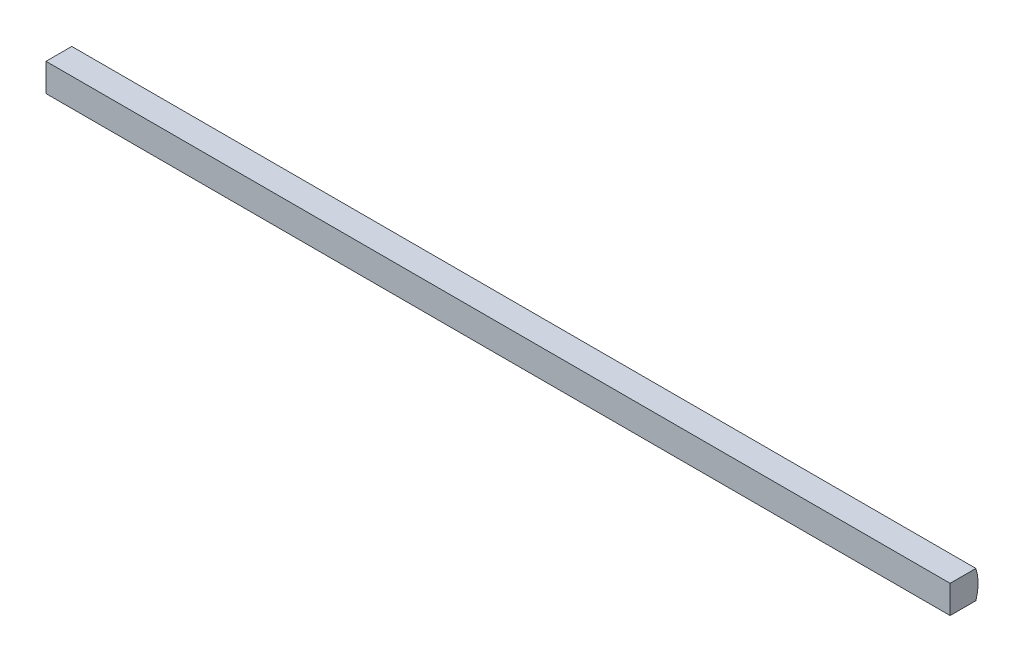
ISO-10303-21;
HEADER;
FILE_DESCRIPTION(('STEP AP214'),'2;1');
FILE_NAME('part.step','',(''),(''),'','','');
FILE_SCHEMA(('AUTOMOTIVE_DESIGN { 1 0 10303 214 1 1 1 1 }'));
ENDSEC;
DATA;
#1=APPLICATION_CONTEXT('core data for automotive mechanical design processes');
#2=APPLICATION_PROTOCOL_DEFINITION('international standard','automotive_design',2000,#1);
#3=PRODUCT_CONTEXT('',#1,'mechanical');
#4=PRODUCT('Part','Part','',(#3));
#5=PRODUCT_RELATED_PRODUCT_CATEGORY('part','',(#4));
#6=PRODUCT_DEFINITION_FORMATION('','',#4);
#7=PRODUCT_DEFINITION_CONTEXT('part definition',#1,'design');
#8=PRODUCT_DEFINITION('design','',#6,#7);
#9=PRODUCT_DEFINITION_SHAPE('','',#8);
#10=(LENGTH_UNIT() NAMED_UNIT(*) SI_UNIT(.MILLI.,.METRE.));
#11=(NAMED_UNIT(*) PLANE_ANGLE_UNIT() SI_UNIT($,.RADIAN.));
#12=(NAMED_UNIT(*) SI_UNIT($,.STERADIAN.) SOLID_ANGLE_UNIT());
#13=UNCERTAINTY_MEASURE_WITH_UNIT(LENGTH_MEASURE(1.E-05),#10,'distance_accuracy_value','');
#14=(GEOMETRIC_REPRESENTATION_CONTEXT(3) GLOBAL_UNCERTAINTY_ASSIGNED_CONTEXT((#13)) GLOBAL_UNIT_ASSIGNED_CONTEXT((#10,
#11,#12)) REPRESENTATION_CONTEXT('',''));
#15=CARTESIAN_POINT('',(0.,0.,0.));
#16=DIRECTION('',(0.,0.,1.));
#17=DIRECTION('',(1.,0.,0.));
#18=AXIS2_PLACEMENT_3D('',#15,#16,#17);
#19=CARTESIAN_POINT('',(-307.975,4.78267749181438,15.5137071280691));
#20=DIRECTION('',(1.,0.,0.));
#21=DIRECTION('',(0.,0.,1.));
#22=AXIS2_PLACEMENT_3D('',#19,#20,#21);
#23=CYLINDRICAL_SURFACE('',#22,15.5137071280691);
#24=CARTESIAN_POINT('',(0.,4.78267749181438,15.5137071280691));
#25=DIRECTION('',(-1.,0.,0.));
#26=DIRECTION('',(0.,0.,1.));
#27=AXIS2_PLACEMENT_3D('',#24,#25,#26);
#28=CIRCLE('',#27,15.5137071280691);
#29=CARTESIAN_POINT('',(0.,0.,0.755621044000001));
#30=VERTEX_POINT('',#29);
#31=CARTESIAN_POINT('',(0.,9.525,0.742604052000002));
#32=VERTEX_POINT('',#31);
#33=EDGE_CURVE('E107',#30,#32,#28,.F.);
#34=ORIENTED_EDGE('',*,*,#33,.F.);
#35=DIRECTION('',(1.,0.,0.));
#36=VECTOR('',#35,1.);
#37=CARTESIAN_POINT('',(-307.975,0.,0.755621044000001));
#38=LINE('',#37,#36);
#39=CARTESIAN_POINT('',(-307.975,0.,0.755621044000001));
#40=VERTEX_POINT('',#39);
#41=EDGE_CURVE('E46',#40,#30,#38,.T.);
#42=ORIENTED_EDGE('',*,*,#41,.F.);
#43=CARTESIAN_POINT('',(-307.975,4.78267749181438,15.5137071280691));
#44=DIRECTION('',(-1.,0.,0.));
#45=DIRECTION('',(0.,0.,1.));
#46=AXIS2_PLACEMENT_3D('',#43,#44,#45);
#47=CIRCLE('',#46,15.5137071280691);
#48=CARTESIAN_POINT('',(-307.975,9.525,0.742604052000002));
#49=VERTEX_POINT('',#48);
#50=EDGE_CURVE('E96',#40,#49,#47,.F.);
#51=ORIENTED_EDGE('',*,*,#50,.T.);
#52=DIRECTION('',(1.,0.,0.));
#53=VECTOR('',#52,1.);
#54=CARTESIAN_POINT('',(-307.975,9.525,0.742604052000002));
#55=LINE('',#54,#53);
#56=EDGE_CURVE('E11',#49,#32,#55,.T.);
#57=ORIENTED_EDGE('',*,*,#56,.T.);
#58=EDGE_LOOP('',(#34,#42,#51,#57));
#59=FACE_BOUND('',#58,.T.);
#60=ADVANCED_FACE('F43',(#59),#23,.T.);
#61=CARTESIAN_POINT('',(-307.975,9.525,0.));
#62=DIRECTION('',(0.,-1.,0.));
#63=DIRECTION('',(0.,0.,1.));
#64=AXIS2_PLACEMENT_3D('',#61,#62,#63);
#65=PLANE('',#64);
#66=DIRECTION('',(0.,0.,1.));
#67=VECTOR('',#66,1.);
#68=CARTESIAN_POINT('',(0.,9.525,0.));
#69=LINE('',#68,#67);
#70=CARTESIAN_POINT('',(0.,9.525,9.525));
#71=VERTEX_POINT('',#70);
#72=EDGE_CURVE('E84',#32,#71,#69,.T.);
#73=ORIENTED_EDGE('',*,*,#72,.F.);
#74=ORIENTED_EDGE('',*,*,#56,.F.);
#75=DIRECTION('',(0.,0.,1.));
#76=VECTOR('',#75,1.);
#77=CARTESIAN_POINT('',(-307.975,9.525,0.));
#78=LINE('',#77,#76);
#79=CARTESIAN_POINT('',(-307.975,9.525,9.525));
#80=VERTEX_POINT('',#79);
#81=EDGE_CURVE('E61',#49,#80,#78,.T.);
#82=ORIENTED_EDGE('',*,*,#81,.T.);
#83=DIRECTION('',(1.,0.,0.));
#84=VECTOR('',#83,1.);
#85=CARTESIAN_POINT('',(-307.975,9.525,9.525));
#86=LINE('',#85,#84);
#87=EDGE_CURVE('E52',#80,#71,#86,.T.);
#88=ORIENTED_EDGE('',*,*,#87,.T.);
#89=EDGE_LOOP('',(#73,#74,#82,#88));
#90=FACE_BOUND('',#89,.T.);
#91=ADVANCED_FACE('F113',(#90),#65,.F.);
#92=CARTESIAN_POINT('',(-307.975,0.,9.525));
#93=DIRECTION('',(0.,0.,1.));
#94=DIRECTION('',(-1.,0.,0.));
#95=AXIS2_PLACEMENT_3D('',#92,#93,#94);
#96=PLANE('',#95);
#97=DIRECTION('',(0.,1.,0.));
#98=VECTOR('',#97,1.);
#99=CARTESIAN_POINT('',(0.,0.,9.525));
#100=LINE('',#99,#98);
#101=CARTESIAN_POINT('',(0.,0.,9.525));
#102=VERTEX_POINT('',#101);
#103=EDGE_CURVE('E78',#102,#71,#100,.T.);
#104=ORIENTED_EDGE('',*,*,#103,.T.);
#105=ORIENTED_EDGE('',*,*,#87,.F.);
#106=DIRECTION('',(0.,1.,0.));
#107=VECTOR('',#106,1.);
#108=CARTESIAN_POINT('',(-307.975,0.,9.525));
#109=LINE('',#108,#107);
#110=CARTESIAN_POINT('',(-307.975,0.,9.525));
#111=VERTEX_POINT('',#110);
#112=EDGE_CURVE('E94',#111,#80,#109,.T.);
#113=ORIENTED_EDGE('',*,*,#112,.F.);
#114=DIRECTION('',(1.,0.,0.));
#115=VECTOR('',#114,1.);
#116=CARTESIAN_POINT('',(-307.975,0.,9.525));
#117=LINE('',#116,#115);
#118=EDGE_CURVE('E99',#111,#102,#117,.T.);
#119=ORIENTED_EDGE('',*,*,#118,.T.);
#120=EDGE_LOOP('',(#104,#105,#113,#119));
#121=FACE_BOUND('',#120,.T.);
#122=ADVANCED_FACE('F102',(#121),#96,.T.);
#123=CARTESIAN_POINT('',(-307.975,0.,0.));
#124=DIRECTION('',(0.,-1.,0.));
#125=DIRECTION('',(0.,0.,1.));
#126=AXIS2_PLACEMENT_3D('',#123,#124,#125);
#127=PLANE('',#126);
#128=DIRECTION('',(0.,0.,1.));
#129=VECTOR('',#128,1.);
#130=CARTESIAN_POINT('',(0.,0.,0.));
#131=LINE('',#130,#129);
#132=EDGE_CURVE('E101',#30,#102,#131,.T.);
#133=ORIENTED_EDGE('',*,*,#132,.T.);
#134=ORIENTED_EDGE('',*,*,#118,.F.);
#135=DIRECTION('',(0.,0.,1.));
#136=VECTOR('',#135,1.);
#137=CARTESIAN_POINT('',(-307.975,0.,0.));
#138=LINE('',#137,#136);
#139=EDGE_CURVE('E91',#40,#111,#138,.T.);
#140=ORIENTED_EDGE('',*,*,#139,.F.);
#141=ORIENTED_EDGE('',*,*,#41,.T.);
#142=EDGE_LOOP('',(#133,#134,#140,#141));
#143=FACE_BOUND('',#142,.T.);
#144=ADVANCED_FACE('F100',(#143),#127,.T.);
#145=CARTESIAN_POINT('',(-307.975,0.,0.));
#146=DIRECTION('',(1.,0.,0.));
#147=DIRECTION('',(0.,0.,1.));
#148=AXIS2_PLACEMENT_3D('',#145,#146,#147);
#149=PLANE('',#148);
#150=ORIENTED_EDGE('',*,*,#50,.F.);
#151=ORIENTED_EDGE('',*,*,#139,.T.);
#152=ORIENTED_EDGE('',*,*,#112,.T.);
#153=ORIENTED_EDGE('',*,*,#81,.F.);
#154=EDGE_LOOP('',(#150,#151,#152,#153));
#155=FACE_BOUND('',#154,.T.);
#156=ADVANCED_FACE('F92',(#155),#149,.F.);
#157=CARTESIAN_POINT('',(0.,0.,0.));
#158=DIRECTION('',(1.,0.,0.));
#159=DIRECTION('',(0.,0.,1.));
#160=AXIS2_PLACEMENT_3D('',#157,#158,#159);
#161=PLANE('',#160);
#162=ORIENTED_EDGE('',*,*,#33,.T.);
#163=ORIENTED_EDGE('',*,*,#72,.T.);
#164=ORIENTED_EDGE('',*,*,#103,.F.);
#165=ORIENTED_EDGE('',*,*,#132,.F.);
#166=EDGE_LOOP('',(#162,#163,#164,#165));
#167=FACE_BOUND('',#166,.T.);
#168=ADVANCED_FACE('F115',(#167),#161,.T.);
#169=CLOSED_SHELL('',(#60,#91,#122,#144,#156,#168));
#170=MANIFOLD_SOLID_BREP('B2',#169);
#171=ADVANCED_BREP_SHAPE_REPRESENTATION('',(#18,#170),#14);
#172=SHAPE_DEFINITION_REPRESENTATION(#9,#171);
ENDSEC;
END-ISO-10303-21;
